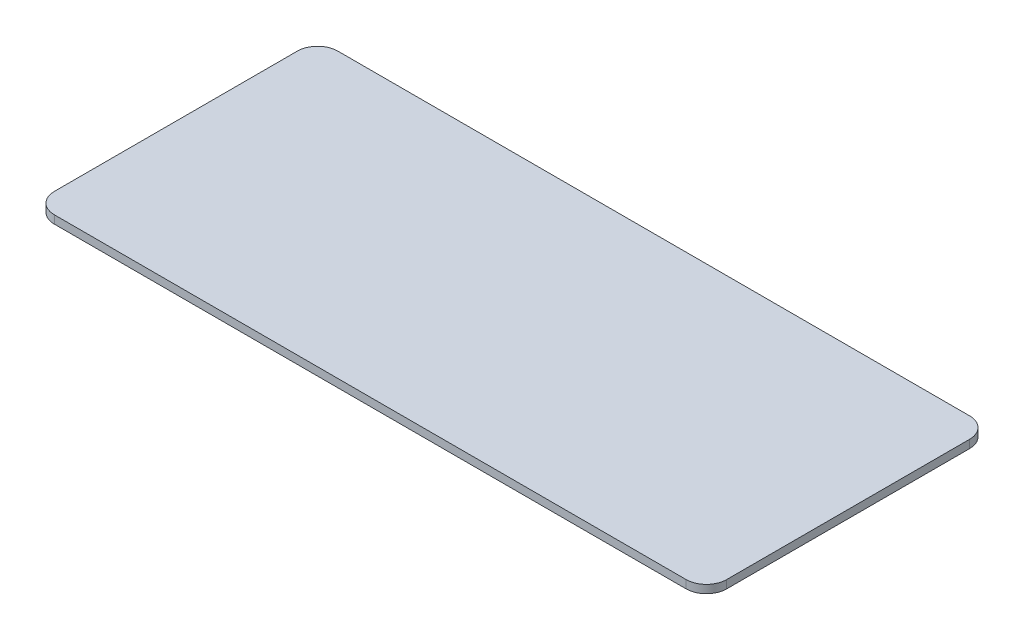
ISO-10303-21;
HEADER;
FILE_DESCRIPTION(('STEP AP214'),'2;1');
FILE_NAME('part.step','',(''),(''),'','','');
FILE_SCHEMA(('AUTOMOTIVE_DESIGN { 1 0 10303 214 1 1 1 1 }'));
ENDSEC;
DATA;
#1=APPLICATION_CONTEXT('core data for automotive mechanical design processes');
#2=APPLICATION_PROTOCOL_DEFINITION('international standard','automotive_design',2000,#1);
#3=PRODUCT_CONTEXT('',#1,'mechanical');
#4=PRODUCT('Part','Part','',(#3));
#5=PRODUCT_RELATED_PRODUCT_CATEGORY('part','',(#4));
#6=PRODUCT_DEFINITION_FORMATION('','',#4);
#7=PRODUCT_DEFINITION_CONTEXT('part definition',#1,'design');
#8=PRODUCT_DEFINITION('design','',#6,#7);
#9=PRODUCT_DEFINITION_SHAPE('','',#8);
#10=(LENGTH_UNIT() NAMED_UNIT(*) SI_UNIT(.MILLI.,.METRE.));
#11=(NAMED_UNIT(*) PLANE_ANGLE_UNIT() SI_UNIT($,.RADIAN.));
#12=(NAMED_UNIT(*) SI_UNIT($,.STERADIAN.) SOLID_ANGLE_UNIT());
#13=UNCERTAINTY_MEASURE_WITH_UNIT(LENGTH_MEASURE(1.E-05),#10,'distance_accuracy_value','');
#14=(GEOMETRIC_REPRESENTATION_CONTEXT(3) GLOBAL_UNCERTAINTY_ASSIGNED_CONTEXT((#13)) GLOBAL_UNIT_ASSIGNED_CONTEXT((#10,
#11,#12)) REPRESENTATION_CONTEXT('',''));
#15=CARTESIAN_POINT('',(0.,0.,0.));
#16=DIRECTION('',(0.,0.,1.));
#17=DIRECTION('',(1.,0.,0.));
#18=AXIS2_PLACEMENT_3D('',#15,#16,#17);
#19=CARTESIAN_POINT('',(0.,2.,0.));
#20=DIRECTION('',(0.,-1.,0.));
#21=DIRECTION('',(0.,0.,-1.));
#22=AXIS2_PLACEMENT_3D('',#19,#20,#21);
#23=PLANE('',#22);
#24=CARTESIAN_POINT('',(62.6371308016877,2.,-42.8481012658228));
#25=DIRECTION('',(0.,-1.,0.));
#26=DIRECTION('',(0.,0.,-1.));
#27=AXIS2_PLACEMENT_3D('',#24,#25,#26);
#28=CIRCLE('',#27,5.);
#29=CARTESIAN_POINT('',(67.6371308016878,2.,-42.8481012658228));
#30=VERTEX_POINT('',#29);
#31=CARTESIAN_POINT('',(62.6371308016877,2.,-47.8481012658228));
#32=VERTEX_POINT('',#31);
#33=EDGE_CURVE('E126',#30,#32,#28,.F.);
#34=ORIENTED_EDGE('',*,*,#33,.T.);
#35=DIRECTION('',(1.,0.,0.));
#36=VECTOR('',#35,1.);
#37=CARTESIAN_POINT('',(-98.3544303797468,2.,-47.8481012658228));
#38=LINE('',#37,#36);
#39=CARTESIAN_POINT('',(-93.3544303797468,2.,-47.8481012658228));
#40=VERTEX_POINT('',#39);
#41=EDGE_CURVE('E166',#40,#32,#38,.T.);
#42=ORIENTED_EDGE('',*,*,#41,.F.);
#43=CARTESIAN_POINT('',(-93.3544303797468,2.,-42.8481012658228));
#44=DIRECTION('',(0.,-1.,0.));
#45=DIRECTION('',(0.,0.,-1.));
#46=AXIS2_PLACEMENT_3D('',#43,#44,#45);
#47=CIRCLE('',#46,5.);
#48=CARTESIAN_POINT('',(-98.3544303797468,2.,-42.8481012658228));
#49=VERTEX_POINT('',#48);
#50=EDGE_CURVE('E113',#40,#49,#47,.F.);
#51=ORIENTED_EDGE('',*,*,#50,.T.);
#52=DIRECTION('',(0.,0.,-1.));
#53=VECTOR('',#52,1.);
#54=CARTESIAN_POINT('',(-98.3544303797468,2.,-47.8481012658228));
#55=LINE('',#54,#53);
#56=CARTESIAN_POINT('',(-98.3544303797468,2.,17.1518987341772));
#57=VERTEX_POINT('',#56);
#58=EDGE_CURVE('E110',#57,#49,#55,.T.);
#59=ORIENTED_EDGE('',*,*,#58,.F.);
#60=CARTESIAN_POINT('',(-93.3544303797468,2.,17.1518987341772));
#61=DIRECTION('',(0.,-1.,0.));
#62=DIRECTION('',(0.,0.,-1.));
#63=AXIS2_PLACEMENT_3D('',#60,#61,#62);
#64=CIRCLE('',#63,5.);
#65=CARTESIAN_POINT('',(-93.3544303797468,2.,22.1518987341772));
#66=VERTEX_POINT('',#65);
#67=EDGE_CURVE('E37',#57,#66,#64,.F.);
#68=ORIENTED_EDGE('',*,*,#67,.T.);
#69=DIRECTION('',(-1.,0.,0.));
#70=VECTOR('',#69,1.);
#71=CARTESIAN_POINT('',(-98.3544303797468,2.,22.1518987341772));
#72=LINE('',#71,#70);
#73=CARTESIAN_POINT('',(62.6371308016878,2.,22.1518987341772));
#74=VERTEX_POINT('',#73);
#75=EDGE_CURVE('E114',#74,#66,#72,.T.);
#76=ORIENTED_EDGE('',*,*,#75,.F.);
#77=CARTESIAN_POINT('',(62.6371308016878,2.,17.1518987341772));
#78=DIRECTION('',(0.,-1.,0.));
#79=DIRECTION('',(0.,0.,-1.));
#80=AXIS2_PLACEMENT_3D('',#77,#78,#79);
#81=CIRCLE('',#80,5.);
#82=CARTESIAN_POINT('',(67.6371308016878,2.,17.1518987341772));
#83=VERTEX_POINT('',#82);
#84=EDGE_CURVE('E108',#74,#83,#81,.F.);
#85=ORIENTED_EDGE('',*,*,#84,.T.);
#86=DIRECTION('',(0.,0.,1.));
#87=VECTOR('',#86,1.);
#88=CARTESIAN_POINT('',(67.6371308016878,2.,-47.8481012658228));
#89=LINE('',#88,#87);
#90=EDGE_CURVE('E129',#30,#83,#89,.T.);
#91=ORIENTED_EDGE('',*,*,#90,.F.);
#92=EDGE_LOOP('',(#34,#42,#51,#59,#68,#76,#85,#91));
#93=FACE_BOUND('',#92,.T.);
#94=ADVANCED_FACE('F33',(#93),#23,.F.);
#95=CARTESIAN_POINT('',(-98.3544303797468,50.,-47.8481012658228));
#96=DIRECTION('',(1.,0.,0.));
#97=DIRECTION('',(0.,0.,-1.));
#98=AXIS2_PLACEMENT_3D('',#95,#96,#97);
#99=PLANE('',#98);
#100=DIRECTION('',(0.,-1.,0.));
#101=VECTOR('',#100,1.);
#102=CARTESIAN_POINT('',(-98.3544303797468,50.,17.1518987341772));
#103=LINE('',#102,#101);
#104=CARTESIAN_POINT('',(-98.3544303797468,0.,17.1518987341772));
#105=VERTEX_POINT('',#104);
#106=EDGE_CURVE('E104',#105,#57,#103,.F.);
#107=ORIENTED_EDGE('',*,*,#106,.T.);
#108=ORIENTED_EDGE('',*,*,#58,.T.);
#109=DIRECTION('',(0.,-1.,0.));
#110=VECTOR('',#109,1.);
#111=CARTESIAN_POINT('',(-98.3544303797468,50.,-42.8481012658228));
#112=LINE('',#111,#110);
#113=CARTESIAN_POINT('',(-98.3544303797468,0.,-42.8481012658228));
#114=VERTEX_POINT('',#113);
#115=EDGE_CURVE('E49',#49,#114,#112,.T.);
#116=ORIENTED_EDGE('',*,*,#115,.T.);
#117=DIRECTION('',(0.,0.,1.));
#118=VECTOR('',#117,1.);
#119=CARTESIAN_POINT('',(-98.3544303797468,0.,-47.8481012658228));
#120=LINE('',#119,#118);
#121=EDGE_CURVE('E11',#114,#105,#120,.T.);
#122=ORIENTED_EDGE('',*,*,#121,.T.);
#123=EDGE_LOOP('',(#107,#108,#116,#122));
#124=FACE_BOUND('',#123,.T.);
#125=ADVANCED_FACE('F116',(#124),#99,.F.);
#126=CARTESIAN_POINT('',(-98.3544303797468,50.,22.1518987341772));
#127=DIRECTION('',(0.,0.,-1.));
#128=DIRECTION('',(-1.,0.,0.));
#129=AXIS2_PLACEMENT_3D('',#126,#127,#128);
#130=PLANE('',#129);
#131=DIRECTION('',(0.,-1.,0.));
#132=VECTOR('',#131,1.);
#133=CARTESIAN_POINT('',(62.6371308016878,50.,22.1518987341772));
#134=LINE('',#133,#132);
#135=CARTESIAN_POINT('',(62.6371308016878,0.,22.1518987341772));
#136=VERTEX_POINT('',#135);
#137=EDGE_CURVE('E165',#136,#74,#134,.F.);
#138=ORIENTED_EDGE('',*,*,#137,.T.);
#139=ORIENTED_EDGE('',*,*,#75,.T.);
#140=DIRECTION('',(0.,-1.,0.));
#141=VECTOR('',#140,1.);
#142=CARTESIAN_POINT('',(-93.3544303797468,50.,22.1518987341772));
#143=LINE('',#142,#141);
#144=CARTESIAN_POINT('',(-93.3544303797468,0.,22.1518987341772));
#145=VERTEX_POINT('',#144);
#146=EDGE_CURVE('E105',#66,#145,#143,.T.);
#147=ORIENTED_EDGE('',*,*,#146,.T.);
#148=DIRECTION('',(1.,0.,0.));
#149=VECTOR('',#148,1.);
#150=CARTESIAN_POINT('',(-98.3544303797468,0.,22.1518987341772));
#151=LINE('',#150,#149);
#152=EDGE_CURVE('E42',#145,#136,#151,.T.);
#153=ORIENTED_EDGE('',*,*,#152,.T.);
#154=EDGE_LOOP('',(#138,#139,#147,#153));
#155=FACE_BOUND('',#154,.T.);
#156=ADVANCED_FACE('F168',(#155),#130,.F.);
#157=CARTESIAN_POINT('',(67.6371308016878,50.,-47.8481012658228));
#158=DIRECTION('',(-1.,0.,0.));
#159=DIRECTION('',(0.,0.,1.));
#160=AXIS2_PLACEMENT_3D('',#157,#158,#159);
#161=PLANE('',#160);
#162=DIRECTION('',(0.,-1.,0.));
#163=VECTOR('',#162,1.);
#164=CARTESIAN_POINT('',(67.6371308016878,50.,-42.8481012658228));
#165=LINE('',#164,#163);
#166=CARTESIAN_POINT('',(67.6371308016878,0.,-42.8481012658228));
#167=VERTEX_POINT('',#166);
#168=EDGE_CURVE('E142',#167,#30,#165,.F.);
#169=ORIENTED_EDGE('',*,*,#168,.T.);
#170=ORIENTED_EDGE('',*,*,#90,.T.);
#171=DIRECTION('',(0.,-1.,0.));
#172=VECTOR('',#171,1.);
#173=CARTESIAN_POINT('',(67.6371308016878,50.,17.1518987341772));
#174=LINE('',#173,#172);
#175=CARTESIAN_POINT('',(67.6371308016878,0.,17.1518987341772));
#176=VERTEX_POINT('',#175);
#177=EDGE_CURVE('E135',#83,#176,#174,.T.);
#178=ORIENTED_EDGE('',*,*,#177,.T.);
#179=DIRECTION('',(0.,0.,-1.));
#180=VECTOR('',#179,1.);
#181=CARTESIAN_POINT('',(67.6371308016878,0.,-47.8481012658228));
#182=LINE('',#181,#180);
#183=EDGE_CURVE('E120',#176,#167,#182,.T.);
#184=ORIENTED_EDGE('',*,*,#183,.T.);
#185=EDGE_LOOP('',(#169,#170,#178,#184));
#186=FACE_BOUND('',#185,.T.);
#187=ADVANCED_FACE('F171',(#186),#161,.F.);
#188=CARTESIAN_POINT('',(-98.3544303797468,50.,-47.8481012658228));
#189=DIRECTION('',(0.,0.,1.));
#190=DIRECTION('',(1.,0.,0.));
#191=AXIS2_PLACEMENT_3D('',#188,#189,#190);
#192=PLANE('',#191);
#193=DIRECTION('',(0.,-1.,0.));
#194=VECTOR('',#193,1.);
#195=CARTESIAN_POINT('',(-93.3544303797468,50.,-47.8481012658228));
#196=LINE('',#195,#194);
#197=CARTESIAN_POINT('',(-93.3544303797468,0.,-47.8481012658228));
#198=VERTEX_POINT('',#197);
#199=EDGE_CURVE('E141',#198,#40,#196,.F.);
#200=ORIENTED_EDGE('',*,*,#199,.T.);
#201=ORIENTED_EDGE('',*,*,#41,.T.);
#202=DIRECTION('',(0.,-1.,0.));
#203=VECTOR('',#202,1.);
#204=CARTESIAN_POINT('',(62.6371308016877,50.,-47.8481012658228));
#205=LINE('',#204,#203);
#206=CARTESIAN_POINT('',(62.6371308016877,0.,-47.8481012658228));
#207=VERTEX_POINT('',#206);
#208=EDGE_CURVE('E145',#32,#207,#205,.T.);
#209=ORIENTED_EDGE('',*,*,#208,.T.);
#210=DIRECTION('',(-1.,0.,0.));
#211=VECTOR('',#210,1.);
#212=CARTESIAN_POINT('',(-98.3544303797468,0.,-47.8481012658228));
#213=LINE('',#212,#211);
#214=EDGE_CURVE('E117',#207,#198,#213,.T.);
#215=ORIENTED_EDGE('',*,*,#214,.T.);
#216=EDGE_LOOP('',(#200,#201,#209,#215));
#217=FACE_BOUND('',#216,.T.);
#218=ADVANCED_FACE('F176',(#217),#192,.F.);
#219=CARTESIAN_POINT('',(-93.3544303797468,50.,-42.8481012658228));
#220=DIRECTION('',(0.,-1.,0.));
#221=DIRECTION('',(0.,0.,-1.));
#222=AXIS2_PLACEMENT_3D('',#219,#220,#221);
#223=CYLINDRICAL_SURFACE('',#222,5.);
#224=ORIENTED_EDGE('',*,*,#50,.F.);
#225=ORIENTED_EDGE('',*,*,#199,.F.);
#226=CARTESIAN_POINT('',(-93.3544303797468,0.,-42.8481012658228));
#227=DIRECTION('',(0.,1.,0.));
#228=DIRECTION('',(0.,0.,1.));
#229=AXIS2_PLACEMENT_3D('',#226,#227,#228);
#230=CIRCLE('',#229,5.);
#231=EDGE_CURVE('E150',#114,#198,#230,.F.);
#232=ORIENTED_EDGE('',*,*,#231,.F.);
#233=ORIENTED_EDGE('',*,*,#115,.F.);
#234=EDGE_LOOP('',(#224,#225,#232,#233));
#235=FACE_BOUND('',#234,.T.);
#236=ADVANCED_FACE('F178',(#235),#223,.T.);
#237=CARTESIAN_POINT('',(62.6371308016877,50.,-42.8481012658228));
#238=DIRECTION('',(0.,-1.,0.));
#239=DIRECTION('',(0.,0.,-1.));
#240=AXIS2_PLACEMENT_3D('',#237,#238,#239);
#241=CYLINDRICAL_SURFACE('',#240,5.);
#242=ORIENTED_EDGE('',*,*,#33,.F.);
#243=ORIENTED_EDGE('',*,*,#168,.F.);
#244=CARTESIAN_POINT('',(62.6371308016877,0.,-42.8481012658228));
#245=DIRECTION('',(0.,1.,0.));
#246=DIRECTION('',(0.,0.,1.));
#247=AXIS2_PLACEMENT_3D('',#244,#245,#246);
#248=CIRCLE('',#247,5.);
#249=EDGE_CURVE('E154',#207,#167,#248,.F.);
#250=ORIENTED_EDGE('',*,*,#249,.F.);
#251=ORIENTED_EDGE('',*,*,#208,.F.);
#252=EDGE_LOOP('',(#242,#243,#250,#251));
#253=FACE_BOUND('',#252,.T.);
#254=ADVANCED_FACE('F173',(#253),#241,.T.);
#255=CARTESIAN_POINT('',(62.6371308016878,50.,17.1518987341772));
#256=DIRECTION('',(0.,-1.,0.));
#257=DIRECTION('',(0.,0.,-1.));
#258=AXIS2_PLACEMENT_3D('',#255,#256,#257);
#259=CYLINDRICAL_SURFACE('',#258,5.);
#260=ORIENTED_EDGE('',*,*,#84,.F.);
#261=ORIENTED_EDGE('',*,*,#137,.F.);
#262=CARTESIAN_POINT('',(62.6371308016878,0.,17.1518987341772));
#263=DIRECTION('',(0.,1.,0.));
#264=DIRECTION('',(0.,0.,1.));
#265=AXIS2_PLACEMENT_3D('',#262,#263,#264);
#266=CIRCLE('',#265,5.);
#267=EDGE_CURVE('E137',#176,#136,#266,.F.);
#268=ORIENTED_EDGE('',*,*,#267,.F.);
#269=ORIENTED_EDGE('',*,*,#177,.F.);
#270=EDGE_LOOP('',(#260,#261,#268,#269));
#271=FACE_BOUND('',#270,.T.);
#272=ADVANCED_FACE('F136',(#271),#259,.T.);
#273=CARTESIAN_POINT('',(-93.3544303797468,50.,17.1518987341772));
#274=DIRECTION('',(0.,-1.,0.));
#275=DIRECTION('',(0.,0.,-1.));
#276=AXIS2_PLACEMENT_3D('',#273,#274,#275);
#277=CYLINDRICAL_SURFACE('',#276,5.);
#278=ORIENTED_EDGE('',*,*,#67,.F.);
#279=ORIENTED_EDGE('',*,*,#106,.F.);
#280=CARTESIAN_POINT('',(-93.3544303797468,0.,17.1518987341772));
#281=DIRECTION('',(0.,1.,0.));
#282=DIRECTION('',(0.,0.,1.));
#283=AXIS2_PLACEMENT_3D('',#280,#281,#282);
#284=CIRCLE('',#283,5.);
#285=EDGE_CURVE('E57',#145,#105,#284,.F.);
#286=ORIENTED_EDGE('',*,*,#285,.F.);
#287=ORIENTED_EDGE('',*,*,#146,.F.);
#288=EDGE_LOOP('',(#278,#279,#286,#287));
#289=FACE_BOUND('',#288,.T.);
#290=ADVANCED_FACE('F35',(#289),#277,.T.);
#291=CARTESIAN_POINT('',(0.,0.,0.));
#292=DIRECTION('',(0.,1.,0.));
#293=DIRECTION('',(0.,0.,1.));
#294=AXIS2_PLACEMENT_3D('',#291,#292,#293);
#295=PLANE('',#294);
#296=ORIENTED_EDGE('',*,*,#121,.F.);
#297=ORIENTED_EDGE('',*,*,#231,.T.);
#298=ORIENTED_EDGE('',*,*,#214,.F.);
#299=ORIENTED_EDGE('',*,*,#249,.T.);
#300=ORIENTED_EDGE('',*,*,#183,.F.);
#301=ORIENTED_EDGE('',*,*,#267,.T.);
#302=ORIENTED_EDGE('',*,*,#152,.F.);
#303=ORIENTED_EDGE('',*,*,#285,.T.);
#304=EDGE_LOOP('',(#296,#297,#298,#299,#300,#301,#302,#303));
#305=FACE_BOUND('',#304,.T.);
#306=ADVANCED_FACE('F169',(#305),#295,.F.);
#307=CLOSED_SHELL('',(#94,#125,#156,#187,#218,#236,#254,#272,#290,#306));
#308=MANIFOLD_SOLID_BREP('B2',#307);
#309=ADVANCED_BREP_SHAPE_REPRESENTATION('',(#18,#308),#14);
#310=SHAPE_DEFINITION_REPRESENTATION(#9,#309);
ENDSEC;
END-ISO-10303-21;
